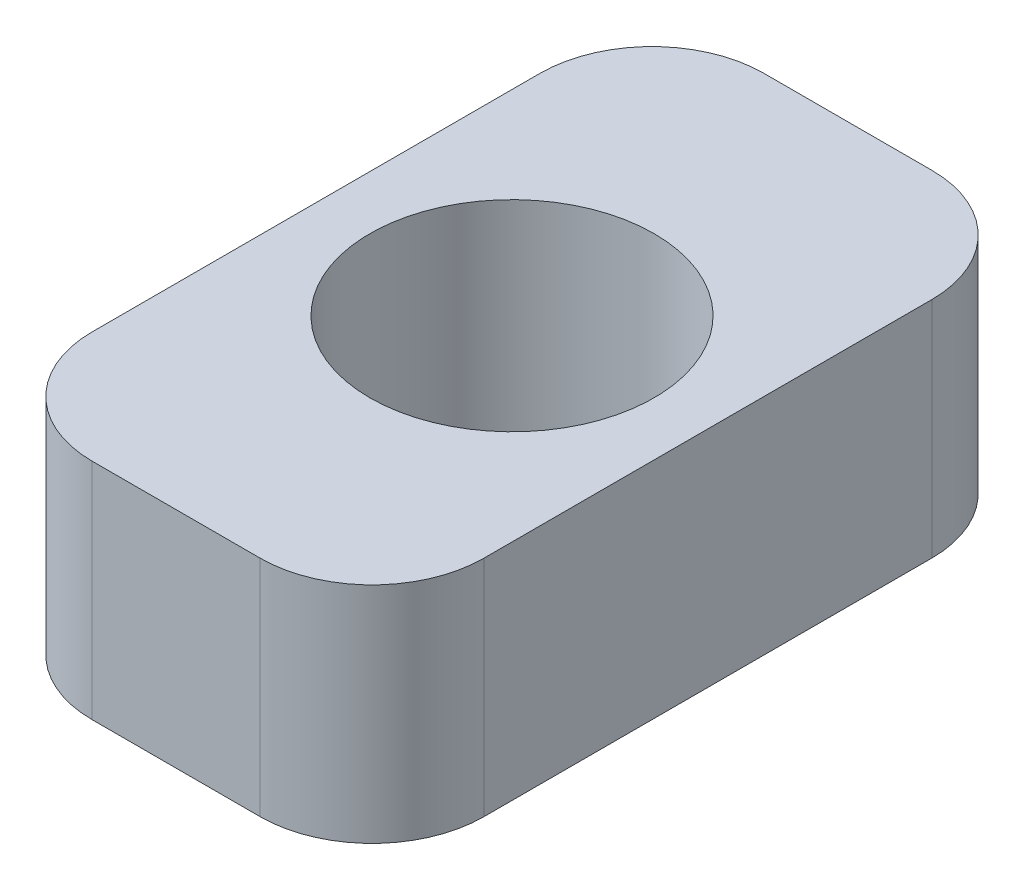
ISO-10303-21;
HEADER;
FILE_DESCRIPTION(('STEP AP214'),'2;1');
FILE_NAME('part.step','',(''),(''),'','','');
FILE_SCHEMA(('AUTOMOTIVE_DESIGN { 1 0 10303 214 1 1 1 1 }'));
ENDSEC;
DATA;
#1=APPLICATION_CONTEXT('core data for automotive mechanical design processes');
#2=APPLICATION_PROTOCOL_DEFINITION('international standard','automotive_design',2000,#1);
#3=PRODUCT_CONTEXT('',#1,'mechanical');
#4=PRODUCT('Part','Part','',(#3));
#5=PRODUCT_RELATED_PRODUCT_CATEGORY('part','',(#4));
#6=PRODUCT_DEFINITION_FORMATION('','',#4);
#7=PRODUCT_DEFINITION_CONTEXT('part definition',#1,'design');
#8=PRODUCT_DEFINITION('design','',#6,#7);
#9=PRODUCT_DEFINITION_SHAPE('','',#8);
#10=(LENGTH_UNIT() NAMED_UNIT(*) SI_UNIT(.MILLI.,.METRE.));
#11=(NAMED_UNIT(*) PLANE_ANGLE_UNIT() SI_UNIT($,.RADIAN.));
#12=(NAMED_UNIT(*) SI_UNIT($,.STERADIAN.) SOLID_ANGLE_UNIT());
#13=UNCERTAINTY_MEASURE_WITH_UNIT(LENGTH_MEASURE(1.E-05),#10,'distance_accuracy_value','');
#14=(GEOMETRIC_REPRESENTATION_CONTEXT(3) GLOBAL_UNCERTAINTY_ASSIGNED_CONTEXT((#13)) GLOBAL_UNIT_ASSIGNED_CONTEXT((#10,
#11,#12)) REPRESENTATION_CONTEXT('',''));
#15=CARTESIAN_POINT('',(0.,0.,0.));
#16=DIRECTION('',(0.,0.,1.));
#17=DIRECTION('',(1.,0.,0.));
#18=AXIS2_PLACEMENT_3D('',#15,#16,#17);
#19=CARTESIAN_POINT('',(0.,20.,0.));
#20=DIRECTION('',(0.,-1.,0.));
#21=DIRECTION('',(0.,0.,-1.));
#22=AXIS2_PLACEMENT_3D('',#19,#20,#21);
#23=PLANE('',#22);
#24=DIRECTION('',(0.,0.,-1.));
#25=VECTOR('',#24,1.);
#26=CARTESIAN_POINT('',(17.5,20.,30.));
#27=LINE('',#26,#25);
#28=CARTESIAN_POINT('',(17.5,20.,20.));
#29=VERTEX_POINT('',#28);
#30=CARTESIAN_POINT('',(17.5,20.,-20.));
#31=VERTEX_POINT('',#30);
#32=EDGE_CURVE('E137',#29,#31,#27,.T.);
#33=ORIENTED_EDGE('',*,*,#32,.T.);
#34=CARTESIAN_POINT('',(7.5,20.,-20.));
#35=DIRECTION('',(0.,-1.,0.));
#36=DIRECTION('',(0.,0.,-1.));
#37=AXIS2_PLACEMENT_3D('',#34,#35,#36);
#38=CIRCLE('',#37,10.);
#39=CARTESIAN_POINT('',(7.5,20.,-30.));
#40=VERTEX_POINT('',#39);
#41=EDGE_CURVE('E152',#31,#40,#38,.F.);
#42=ORIENTED_EDGE('',*,*,#41,.T.);
#43=DIRECTION('',(-1.,0.,0.));
#44=VECTOR('',#43,1.);
#45=CARTESIAN_POINT('',(-17.5,20.,-30.));
#46=LINE('',#45,#44);
#47=CARTESIAN_POINT('',(-7.5,20.,-30.));
#48=VERTEX_POINT('',#47);
#49=EDGE_CURVE('E119',#40,#48,#46,.T.);
#50=ORIENTED_EDGE('',*,*,#49,.T.);
#51=CARTESIAN_POINT('',(-7.5,20.,-20.));
#52=DIRECTION('',(0.,-1.,0.));
#53=DIRECTION('',(0.,0.,-1.));
#54=AXIS2_PLACEMENT_3D('',#51,#52,#53);
#55=CIRCLE('',#54,10.);
#56=CARTESIAN_POINT('',(-17.5,20.,-20.));
#57=VERTEX_POINT('',#56);
#58=EDGE_CURVE('E150',#48,#57,#55,.F.);
#59=ORIENTED_EDGE('',*,*,#58,.T.);
#60=DIRECTION('',(0.,0.,1.));
#61=VECTOR('',#60,1.);
#62=CARTESIAN_POINT('',(-17.5,20.,30.));
#63=LINE('',#62,#61);
#64=CARTESIAN_POINT('',(-17.5,20.,20.));
#65=VERTEX_POINT('',#64);
#66=EDGE_CURVE('E163',#57,#65,#63,.T.);
#67=ORIENTED_EDGE('',*,*,#66,.T.);
#68=CARTESIAN_POINT('',(-7.5,20.,20.));
#69=DIRECTION('',(0.,-1.,0.));
#70=DIRECTION('',(0.,0.,-1.));
#71=AXIS2_PLACEMENT_3D('',#68,#69,#70);
#72=CIRCLE('',#71,10.);
#73=CARTESIAN_POINT('',(-7.5,20.,30.));
#74=VERTEX_POINT('',#73);
#75=EDGE_CURVE('E54',#65,#74,#72,.F.);
#76=ORIENTED_EDGE('',*,*,#75,.T.);
#77=DIRECTION('',(1.,0.,0.));
#78=VECTOR('',#77,1.);
#79=CARTESIAN_POINT('',(-17.5,20.,30.));
#80=LINE('',#79,#78);
#81=CARTESIAN_POINT('',(7.5,20.,30.));
#82=VERTEX_POINT('',#81);
#83=EDGE_CURVE('E138',#74,#82,#80,.T.);
#84=ORIENTED_EDGE('',*,*,#83,.T.);
#85=CARTESIAN_POINT('',(7.50000000000001,20.,20.));
#86=DIRECTION('',(0.,-1.,0.));
#87=DIRECTION('',(0.,0.,-1.));
#88=AXIS2_PLACEMENT_3D('',#85,#86,#87);
#89=CIRCLE('',#88,10.);
#90=EDGE_CURVE('E147',#82,#29,#89,.F.);
#91=ORIENTED_EDGE('',*,*,#90,.T.);
#92=EDGE_LOOP('',(#33,#42,#50,#59,#67,#76,#84,#91));
#93=FACE_BOUND('',#92,.T.);
#94=CARTESIAN_POINT('',(0.,20.,0.));
#95=DIRECTION('',(0.,1.,0.));
#96=DIRECTION('',(0.,0.,1.));
#97=AXIS2_PLACEMENT_3D('',#94,#95,#96);
#98=CIRCLE('',#97,12.7);
#99=CARTESIAN_POINT('',(0.,20.,12.7));
#100=VERTEX_POINT('',#99);
#101=EDGE_CURVE('E132',#100,#100,#98,.T.);
#102=ORIENTED_EDGE('',*,*,#101,.F.);
#103=EDGE_LOOP('',(#102));
#104=FACE_BOUND('',#103,.T.);
#105=ADVANCED_FACE('F33',(#93,#104),#23,.F.);
#106=CARTESIAN_POINT('',(0.,0.,0.));
#107=DIRECTION('',(0.,-1.,0.));
#108=DIRECTION('',(0.,0.,-1.));
#109=AXIS2_PLACEMENT_3D('',#106,#107,#108);
#110=PLANE('',#109);
#111=DIRECTION('',(-1.,0.,0.));
#112=VECTOR('',#111,1.);
#113=CARTESIAN_POINT('',(-17.5,0.,-30.));
#114=LINE('',#113,#112);
#115=CARTESIAN_POINT('',(7.5,0.,-30.));
#116=VERTEX_POINT('',#115);
#117=CARTESIAN_POINT('',(-7.5,0.,-30.));
#118=VERTEX_POINT('',#117);
#119=EDGE_CURVE('E116',#116,#118,#114,.T.);
#120=ORIENTED_EDGE('',*,*,#119,.F.);
#121=CARTESIAN_POINT('',(7.5,0.,-20.));
#122=DIRECTION('',(0.,-1.,0.));
#123=DIRECTION('',(0.,0.,-1.));
#124=AXIS2_PLACEMENT_3D('',#121,#122,#123);
#125=CIRCLE('',#124,10.);
#126=CARTESIAN_POINT('',(17.5,0.,-20.));
#127=VERTEX_POINT('',#126);
#128=EDGE_CURVE('E99',#116,#127,#125,.T.);
#129=ORIENTED_EDGE('',*,*,#128,.T.);
#130=DIRECTION('',(0.,0.,-1.));
#131=VECTOR('',#130,1.);
#132=CARTESIAN_POINT('',(17.5,0.,30.));
#133=LINE('',#132,#131);
#134=CARTESIAN_POINT('',(17.5,0.,20.));
#135=VERTEX_POINT('',#134);
#136=EDGE_CURVE('E127',#135,#127,#133,.T.);
#137=ORIENTED_EDGE('',*,*,#136,.F.);
#138=CARTESIAN_POINT('',(7.50000000000001,0.,20.));
#139=DIRECTION('',(0.,-1.,0.));
#140=DIRECTION('',(0.,0.,-1.));
#141=AXIS2_PLACEMENT_3D('',#138,#139,#140);
#142=CIRCLE('',#141,10.);
#143=CARTESIAN_POINT('',(7.5,0.,30.));
#144=VERTEX_POINT('',#143);
#145=EDGE_CURVE('E120',#135,#144,#142,.T.);
#146=ORIENTED_EDGE('',*,*,#145,.T.);
#147=DIRECTION('',(1.,0.,0.));
#148=VECTOR('',#147,1.);
#149=CARTESIAN_POINT('',(-17.5,0.,30.));
#150=LINE('',#149,#148);
#151=CARTESIAN_POINT('',(-7.5,0.,30.));
#152=VERTEX_POINT('',#151);
#153=EDGE_CURVE('E130',#152,#144,#150,.T.);
#154=ORIENTED_EDGE('',*,*,#153,.F.);
#155=CARTESIAN_POINT('',(-7.5,0.,20.));
#156=DIRECTION('',(0.,-1.,0.));
#157=DIRECTION('',(0.,0.,-1.));
#158=AXIS2_PLACEMENT_3D('',#155,#156,#157);
#159=CIRCLE('',#158,10.);
#160=CARTESIAN_POINT('',(-17.5,0.,20.));
#161=VERTEX_POINT('',#160);
#162=EDGE_CURVE('E141',#152,#161,#159,.T.);
#163=ORIENTED_EDGE('',*,*,#162,.T.);
#164=DIRECTION('',(0.,0.,1.));
#165=VECTOR('',#164,1.);
#166=CARTESIAN_POINT('',(-17.5,0.,30.));
#167=LINE('',#166,#165);
#168=CARTESIAN_POINT('',(-17.5,0.,-20.));
#169=VERTEX_POINT('',#168);
#170=EDGE_CURVE('E126',#169,#161,#167,.T.);
#171=ORIENTED_EDGE('',*,*,#170,.F.);
#172=CARTESIAN_POINT('',(-7.5,0.,-20.));
#173=DIRECTION('',(0.,-1.,0.));
#174=DIRECTION('',(0.,0.,-1.));
#175=AXIS2_PLACEMENT_3D('',#172,#173,#174);
#176=CIRCLE('',#175,10.);
#177=EDGE_CURVE('E110',#169,#118,#176,.T.);
#178=ORIENTED_EDGE('',*,*,#177,.T.);
#179=EDGE_LOOP('',(#120,#129,#137,#146,#154,#163,#171,#178));
#180=FACE_BOUND('',#179,.T.);
#181=CARTESIAN_POINT('',(0.,0.,0.));
#182=DIRECTION('',(0.,1.,0.));
#183=DIRECTION('',(0.,0.,1.));
#184=AXIS2_PLACEMENT_3D('',#181,#182,#183);
#185=CIRCLE('',#184,12.7);
#186=CARTESIAN_POINT('',(0.,0.,12.7));
#187=VERTEX_POINT('',#186);
#188=EDGE_CURVE('E177',#187,#187,#185,.T.);
#189=ORIENTED_EDGE('',*,*,#188,.T.);
#190=EDGE_LOOP('',(#189));
#191=FACE_BOUND('',#190,.T.);
#192=ADVANCED_FACE('F123',(#180,#191),#110,.T.);
#193=CARTESIAN_POINT('',(17.5,20.,30.));
#194=DIRECTION('',(-1.,0.,0.));
#195=DIRECTION('',(0.,0.,1.));
#196=AXIS2_PLACEMENT_3D('',#193,#194,#195);
#197=PLANE('',#196);
#198=ORIENTED_EDGE('',*,*,#136,.T.);
#199=DIRECTION('',(0.,-1.,0.));
#200=VECTOR('',#199,1.);
#201=CARTESIAN_POINT('',(17.5,20.,-20.));
#202=LINE('',#201,#200);
#203=EDGE_CURVE('E104',#127,#31,#202,.F.);
#204=ORIENTED_EDGE('',*,*,#203,.T.);
#205=ORIENTED_EDGE('',*,*,#32,.F.);
#206=DIRECTION('',(0.,-1.,0.));
#207=VECTOR('',#206,1.);
#208=CARTESIAN_POINT('',(17.5,20.,20.));
#209=LINE('',#208,#207);
#210=EDGE_CURVE('E109',#29,#135,#209,.T.);
#211=ORIENTED_EDGE('',*,*,#210,.T.);
#212=EDGE_LOOP('',(#198,#204,#205,#211));
#213=FACE_BOUND('',#212,.T.);
#214=ADVANCED_FACE('F191',(#213),#197,.F.);
#215=CARTESIAN_POINT('',(-17.5,20.,-30.));
#216=DIRECTION('',(0.,0.,1.));
#217=DIRECTION('',(1.,0.,0.));
#218=AXIS2_PLACEMENT_3D('',#215,#216,#217);
#219=PLANE('',#218);
#220=ORIENTED_EDGE('',*,*,#49,.F.);
#221=DIRECTION('',(0.,-1.,0.));
#222=VECTOR('',#221,1.);
#223=CARTESIAN_POINT('',(7.5,20.,-30.));
#224=LINE('',#223,#222);
#225=EDGE_CURVE('E103',#40,#116,#224,.T.);
#226=ORIENTED_EDGE('',*,*,#225,.T.);
#227=ORIENTED_EDGE('',*,*,#119,.T.);
#228=DIRECTION('',(0.,-1.,0.));
#229=VECTOR('',#228,1.);
#230=CARTESIAN_POINT('',(-7.5,20.,-30.));
#231=LINE('',#230,#229);
#232=EDGE_CURVE('E121',#118,#48,#231,.F.);
#233=ORIENTED_EDGE('',*,*,#232,.T.);
#234=EDGE_LOOP('',(#220,#226,#227,#233));
#235=FACE_BOUND('',#234,.T.);
#236=ADVANCED_FACE('F115',(#235),#219,.F.);
#237=CARTESIAN_POINT('',(-17.5,20.,30.));
#238=DIRECTION('',(1.,0.,0.));
#239=DIRECTION('',(0.,0.,-1.));
#240=AXIS2_PLACEMENT_3D('',#237,#238,#239);
#241=PLANE('',#240);
#242=ORIENTED_EDGE('',*,*,#66,.F.);
#243=DIRECTION('',(0.,-1.,0.));
#244=VECTOR('',#243,1.);
#245=CARTESIAN_POINT('',(-17.5,20.,-20.));
#246=LINE('',#245,#244);
#247=EDGE_CURVE('E156',#57,#169,#246,.T.);
#248=ORIENTED_EDGE('',*,*,#247,.T.);
#249=ORIENTED_EDGE('',*,*,#170,.T.);
#250=DIRECTION('',(0.,-1.,0.));
#251=VECTOR('',#250,1.);
#252=CARTESIAN_POINT('',(-17.5,20.,20.));
#253=LINE('',#252,#251);
#254=EDGE_CURVE('E154',#161,#65,#253,.F.);
#255=ORIENTED_EDGE('',*,*,#254,.T.);
#256=EDGE_LOOP('',(#242,#248,#249,#255));
#257=FACE_BOUND('',#256,.T.);
#258=ADVANCED_FACE('F161',(#257),#241,.F.);
#259=CARTESIAN_POINT('',(-17.5,20.,30.));
#260=DIRECTION('',(0.,0.,-1.));
#261=DIRECTION('',(-1.,0.,0.));
#262=AXIS2_PLACEMENT_3D('',#259,#260,#261);
#263=PLANE('',#262);
#264=ORIENTED_EDGE('',*,*,#83,.F.);
#265=DIRECTION('',(0.,-1.,0.));
#266=VECTOR('',#265,1.);
#267=CARTESIAN_POINT('',(-7.5,20.,30.));
#268=LINE('',#267,#266);
#269=EDGE_CURVE('E11',#74,#152,#268,.T.);
#270=ORIENTED_EDGE('',*,*,#269,.T.);
#271=ORIENTED_EDGE('',*,*,#153,.T.);
#272=DIRECTION('',(0.,-1.,0.));
#273=VECTOR('',#272,1.);
#274=CARTESIAN_POINT('',(7.5,20.,30.));
#275=LINE('',#274,#273);
#276=EDGE_CURVE('E41',#144,#82,#275,.F.);
#277=ORIENTED_EDGE('',*,*,#276,.T.);
#278=EDGE_LOOP('',(#264,#270,#271,#277));
#279=FACE_BOUND('',#278,.T.);
#280=ADVANCED_FACE('F170',(#279),#263,.F.);
#281=CARTESIAN_POINT('',(0.,20.,0.));
#282=DIRECTION('',(0.,-1.,0.));
#283=DIRECTION('',(0.,0.,-1.));
#284=AXIS2_PLACEMENT_3D('',#281,#282,#283);
#285=CYLINDRICAL_SURFACE('',#284,12.7);
#286=ORIENTED_EDGE('',*,*,#101,.T.);
#287=EDGE_LOOP('',(#286));
#288=FACE_BOUND('',#287,.T.);
#289=ORIENTED_EDGE('',*,*,#188,.F.);
#290=EDGE_LOOP('',(#289));
#291=FACE_BOUND('',#290,.T.);
#292=ADVANCED_FACE('F183',(#288,#291),#285,.F.);
#293=CARTESIAN_POINT('',(7.5,20.,-20.));
#294=DIRECTION('',(0.,-1.,0.));
#295=DIRECTION('',(0.,0.,-1.));
#296=AXIS2_PLACEMENT_3D('',#293,#294,#295);
#297=CYLINDRICAL_SURFACE('',#296,10.);
#298=ORIENTED_EDGE('',*,*,#41,.F.);
#299=ORIENTED_EDGE('',*,*,#203,.F.);
#300=ORIENTED_EDGE('',*,*,#128,.F.);
#301=ORIENTED_EDGE('',*,*,#225,.F.);
#302=EDGE_LOOP('',(#298,#299,#300,#301));
#303=FACE_BOUND('',#302,.T.);
#304=ADVANCED_FACE('F102',(#303),#297,.T.);
#305=CARTESIAN_POINT('',(-7.5,20.,-20.));
#306=DIRECTION('',(0.,-1.,0.));
#307=DIRECTION('',(0.,0.,-1.));
#308=AXIS2_PLACEMENT_3D('',#305,#306,#307);
#309=CYLINDRICAL_SURFACE('',#308,10.);
#310=ORIENTED_EDGE('',*,*,#58,.F.);
#311=ORIENTED_EDGE('',*,*,#232,.F.);
#312=ORIENTED_EDGE('',*,*,#177,.F.);
#313=ORIENTED_EDGE('',*,*,#247,.F.);
#314=EDGE_LOOP('',(#310,#311,#312,#313));
#315=FACE_BOUND('',#314,.T.);
#316=ADVANCED_FACE('F206',(#315),#309,.T.);
#317=CARTESIAN_POINT('',(-7.5,20.,20.));
#318=DIRECTION('',(0.,-1.,0.));
#319=DIRECTION('',(0.,0.,-1.));
#320=AXIS2_PLACEMENT_3D('',#317,#318,#319);
#321=CYLINDRICAL_SURFACE('',#320,10.);
#322=ORIENTED_EDGE('',*,*,#75,.F.);
#323=ORIENTED_EDGE('',*,*,#254,.F.);
#324=ORIENTED_EDGE('',*,*,#162,.F.);
#325=ORIENTED_EDGE('',*,*,#269,.F.);
#326=EDGE_LOOP('',(#322,#323,#324,#325));
#327=FACE_BOUND('',#326,.T.);
#328=ADVANCED_FACE('F169',(#327),#321,.T.);
#329=CARTESIAN_POINT('',(7.50000000000001,20.,20.));
#330=DIRECTION('',(0.,-1.,0.));
#331=DIRECTION('',(0.,0.,-1.));
#332=AXIS2_PLACEMENT_3D('',#329,#330,#331);
#333=CYLINDRICAL_SURFACE('',#332,10.);
#334=ORIENTED_EDGE('',*,*,#90,.F.);
#335=ORIENTED_EDGE('',*,*,#276,.F.);
#336=ORIENTED_EDGE('',*,*,#145,.F.);
#337=ORIENTED_EDGE('',*,*,#210,.F.);
#338=EDGE_LOOP('',(#334,#335,#336,#337));
#339=FACE_BOUND('',#338,.T.);
#340=ADVANCED_FACE('F35',(#339),#333,.T.);
#341=CLOSED_SHELL('',(#105,#192,#214,#236,#258,#280,#292,#304,#316,#328,#340));
#342=MANIFOLD_SOLID_BREP('B2',#341);
#343=ADVANCED_BREP_SHAPE_REPRESENTATION('',(#18,#342),#14);
#344=SHAPE_DEFINITION_REPRESENTATION(#9,#343);
ENDSEC;
END-ISO-10303-21;
